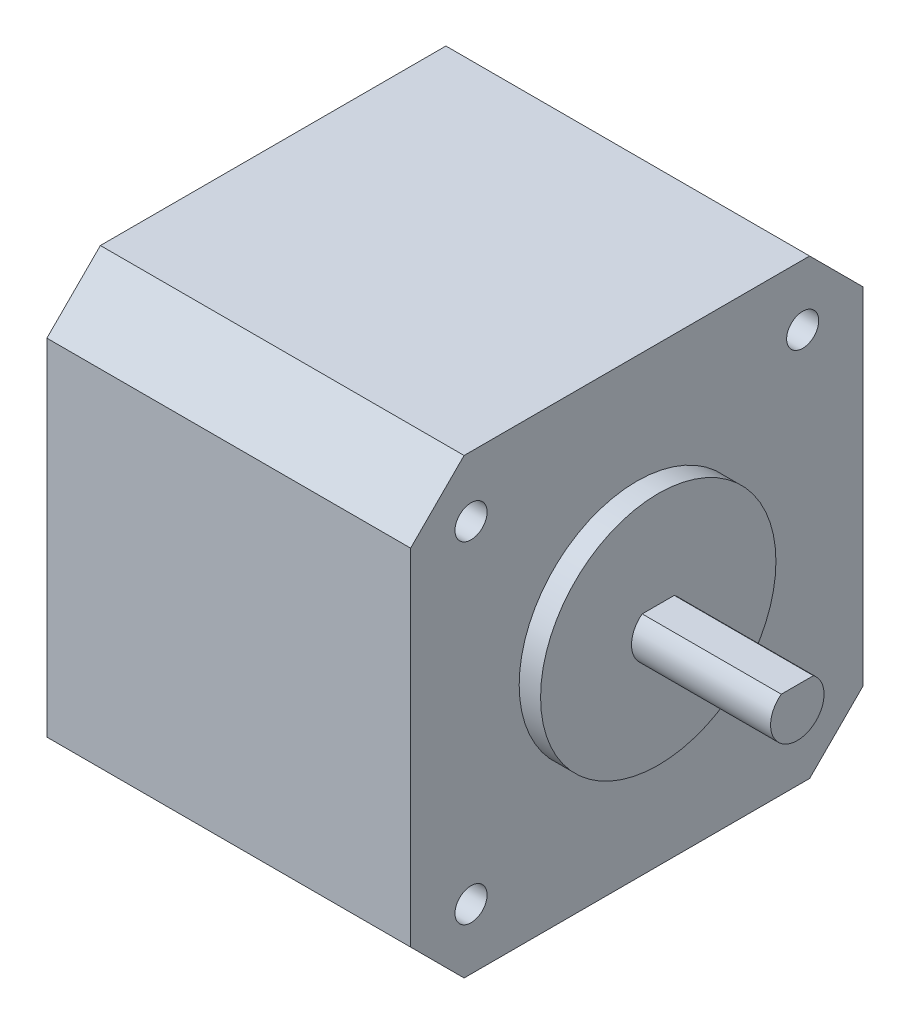
ISO-10303-21;
HEADER;
FILE_DESCRIPTION(('STEP AP214'),'2;1');
FILE_NAME('part.step','',(''),(''),'','','');
FILE_SCHEMA(('AUTOMOTIVE_DESIGN { 1 0 10303 214 1 1 1 1 }'));
ENDSEC;
DATA;
#1=APPLICATION_CONTEXT('core data for automotive mechanical design processes');
#2=APPLICATION_PROTOCOL_DEFINITION('international standard','automotive_design',2000,#1);
#3=PRODUCT_CONTEXT('',#1,'mechanical');
#4=PRODUCT('Part','Part','',(#3));
#5=PRODUCT_RELATED_PRODUCT_CATEGORY('part','',(#4));
#6=PRODUCT_DEFINITION_FORMATION('','',#4);
#7=PRODUCT_DEFINITION_CONTEXT('part definition',#1,'design');
#8=PRODUCT_DEFINITION('design','',#6,#7);
#9=PRODUCT_DEFINITION_SHAPE('','',#8);
#10=(LENGTH_UNIT() NAMED_UNIT(*) SI_UNIT(.MILLI.,.METRE.));
#11=(NAMED_UNIT(*) PLANE_ANGLE_UNIT() SI_UNIT($,.RADIAN.));
#12=(NAMED_UNIT(*) SI_UNIT($,.STERADIAN.) SOLID_ANGLE_UNIT());
#13=UNCERTAINTY_MEASURE_WITH_UNIT(LENGTH_MEASURE(1.E-05),#10,'distance_accuracy_value','');
#14=(GEOMETRIC_REPRESENTATION_CONTEXT(3) GLOBAL_UNCERTAINTY_ASSIGNED_CONTEXT((#13)) GLOBAL_UNIT_ASSIGNED_CONTEXT((#10,
#11,#12)) REPRESENTATION_CONTEXT('',''));
#15=CARTESIAN_POINT('',(0.,0.,0.));
#16=DIRECTION('',(0.,0.,1.));
#17=DIRECTION('',(1.,0.,0.));
#18=AXIS2_PLACEMENT_3D('',#15,#16,#17);
#19=CARTESIAN_POINT('',(34.,0.,-42.3));
#20=DIRECTION('',(0.,0.,1.));
#21=DIRECTION('',(1.,0.,0.));
#22=AXIS2_PLACEMENT_3D('',#19,#20,#21);
#23=PLANE('',#22);
#24=DIRECTION('',(0.,1.,0.));
#25=VECTOR('',#24,1.);
#26=CARTESIAN_POINT('',(0.,0.,-42.3));
#27=LINE('',#26,#25);
#28=CARTESIAN_POINT('',(0.,5.,-42.3));
#29=VERTEX_POINT('',#28);
#30=CARTESIAN_POINT('',(0.,37.3,-42.3));
#31=VERTEX_POINT('',#30);
#32=EDGE_CURVE('E158',#29,#31,#27,.T.);
#33=ORIENTED_EDGE('',*,*,#32,.T.);
#34=DIRECTION('',(-1.,0.,0.));
#35=VECTOR('',#34,1.);
#36=CARTESIAN_POINT('',(34.,37.3,-42.3));
#37=LINE('',#36,#35);
#38=CARTESIAN_POINT('',(34.,37.3,-42.3));
#39=VERTEX_POINT('',#38);
#40=EDGE_CURVE('E11',#39,#31,#37,.T.);
#41=ORIENTED_EDGE('',*,*,#40,.F.);
#42=DIRECTION('',(0.,1.,0.));
#43=VECTOR('',#42,1.);
#44=CARTESIAN_POINT('',(34.,0.,-42.3));
#45=LINE('',#44,#43);
#46=CARTESIAN_POINT('',(34.,5.,-42.3));
#47=VERTEX_POINT('',#46);
#48=EDGE_CURVE('E203',#47,#39,#45,.T.);
#49=ORIENTED_EDGE('',*,*,#48,.F.);
#50=DIRECTION('',(-1.,0.,0.));
#51=VECTOR('',#50,1.);
#52=CARTESIAN_POINT('',(34.,5.,-42.3));
#53=LINE('',#52,#51);
#54=EDGE_CURVE('E141',#47,#29,#53,.T.);
#55=ORIENTED_EDGE('',*,*,#54,.T.);
#56=EDGE_LOOP('',(#33,#41,#49,#55));
#57=FACE_BOUND('',#56,.T.);
#58=ADVANCED_FACE('F36',(#57),#23,.F.);
#59=CARTESIAN_POINT('',(34.,39.8,-39.8));
#60=DIRECTION('',(0.,-0.707106781186547,0.707106781186547));
#61=DIRECTION('',(0.,-0.707106781186548,-0.707106781186548));
#62=AXIS2_PLACEMENT_3D('',#59,#60,#61);
#63=PLANE('',#62);
#64=DIRECTION('',(0.,0.707106781186548,0.707106781186548));
#65=VECTOR('',#64,1.);
#66=CARTESIAN_POINT('',(0.,39.8,-39.8));
#67=LINE('',#66,#65);
#68=CARTESIAN_POINT('',(0.,42.3,-37.3));
#69=VERTEX_POINT('',#68);
#70=EDGE_CURVE('E161',#31,#69,#67,.T.);
#71=ORIENTED_EDGE('',*,*,#70,.T.);
#72=DIRECTION('',(-1.,0.,0.));
#73=VECTOR('',#72,1.);
#74=CARTESIAN_POINT('',(34.,42.3,-37.3));
#75=LINE('',#74,#73);
#76=CARTESIAN_POINT('',(34.,42.3,-37.3));
#77=VERTEX_POINT('',#76);
#78=EDGE_CURVE('E44',#77,#69,#75,.T.);
#79=ORIENTED_EDGE('',*,*,#78,.F.);
#80=DIRECTION('',(0.,0.707106781186548,0.707106781186548));
#81=VECTOR('',#80,1.);
#82=CARTESIAN_POINT('',(34.,39.8,-39.8));
#83=LINE('',#82,#81);
#84=EDGE_CURVE('E101',#39,#77,#83,.T.);
#85=ORIENTED_EDGE('',*,*,#84,.F.);
#86=ORIENTED_EDGE('',*,*,#40,.T.);
#87=EDGE_LOOP('',(#71,#79,#85,#86));
#88=FACE_BOUND('',#87,.T.);
#89=ADVANCED_FACE('F190',(#88),#63,.F.);
#90=CARTESIAN_POINT('',(34.,42.3,0.));
#91=DIRECTION('',(0.,1.,0.));
#92=DIRECTION('',(0.,0.,1.));
#93=AXIS2_PLACEMENT_3D('',#90,#91,#92);
#94=PLANE('',#93);
#95=DIRECTION('',(0.,0.,-1.));
#96=VECTOR('',#95,1.);
#97=CARTESIAN_POINT('',(0.,42.3,0.));
#98=LINE('',#97,#96);
#99=CARTESIAN_POINT('',(0.,42.3,-5.));
#100=VERTEX_POINT('',#99);
#101=EDGE_CURVE('E164',#100,#69,#98,.T.);
#102=ORIENTED_EDGE('',*,*,#101,.F.);
#103=DIRECTION('',(-1.,0.,0.));
#104=VECTOR('',#103,1.);
#105=CARTESIAN_POINT('',(34.,42.3,-5.));
#106=LINE('',#105,#104);
#107=CARTESIAN_POINT('',(34.,42.3,-5.));
#108=VERTEX_POINT('',#107);
#109=EDGE_CURVE('E183',#108,#100,#106,.T.);
#110=ORIENTED_EDGE('',*,*,#109,.F.);
#111=DIRECTION('',(0.,0.,-1.));
#112=VECTOR('',#111,1.);
#113=CARTESIAN_POINT('',(34.,42.3,0.));
#114=LINE('',#113,#112);
#115=EDGE_CURVE('E189',#108,#77,#114,.T.);
#116=ORIENTED_EDGE('',*,*,#115,.T.);
#117=ORIENTED_EDGE('',*,*,#78,.T.);
#118=EDGE_LOOP('',(#102,#110,#116,#117));
#119=FACE_BOUND('',#118,.T.);
#120=ADVANCED_FACE('F187',(#119),#94,.T.);
#121=CARTESIAN_POINT('',(34.,18.65,18.65));
#122=DIRECTION('',(0.,0.707106781186548,0.707106781186547));
#123=DIRECTION('',(0.,-0.707106781186547,0.707106781186548));
#124=AXIS2_PLACEMENT_3D('',#121,#122,#123);
#125=PLANE('',#124);
#126=DIRECTION('',(0.,0.707106781186547,-0.707106781186548));
#127=VECTOR('',#126,1.);
#128=CARTESIAN_POINT('',(0.,18.65,18.65));
#129=LINE('',#128,#127);
#130=CARTESIAN_POINT('',(0.,37.3,0.));
#131=VERTEX_POINT('',#130);
#132=EDGE_CURVE('E167',#131,#100,#129,.T.);
#133=ORIENTED_EDGE('',*,*,#132,.F.);
#134=DIRECTION('',(-1.,0.,0.));
#135=VECTOR('',#134,1.);
#136=CARTESIAN_POINT('',(34.,37.3,0.));
#137=LINE('',#136,#135);
#138=CARTESIAN_POINT('',(34.,37.3,0.));
#139=VERTEX_POINT('',#138);
#140=EDGE_CURVE('E181',#139,#131,#137,.T.);
#141=ORIENTED_EDGE('',*,*,#140,.F.);
#142=DIRECTION('',(0.,0.707106781186547,-0.707106781186548));
#143=VECTOR('',#142,1.);
#144=CARTESIAN_POINT('',(34.,18.65,18.65));
#145=LINE('',#144,#143);
#146=EDGE_CURVE('E200',#139,#108,#145,.T.);
#147=ORIENTED_EDGE('',*,*,#146,.T.);
#148=ORIENTED_EDGE('',*,*,#109,.T.);
#149=EDGE_LOOP('',(#133,#141,#147,#148));
#150=FACE_BOUND('',#149,.T.);
#151=ADVANCED_FACE('F198',(#150),#125,.T.);
#152=CARTESIAN_POINT('',(34.,0.,0.));
#153=DIRECTION('',(0.,0.,1.));
#154=DIRECTION('',(1.,0.,0.));
#155=AXIS2_PLACEMENT_3D('',#152,#153,#154);
#156=PLANE('',#155);
#157=DIRECTION('',(0.,1.,0.));
#158=VECTOR('',#157,1.);
#159=CARTESIAN_POINT('',(0.,0.,0.));
#160=LINE('',#159,#158);
#161=CARTESIAN_POINT('',(0.,5.,0.));
#162=VERTEX_POINT('',#161);
#163=EDGE_CURVE('E170',#162,#131,#160,.T.);
#164=ORIENTED_EDGE('',*,*,#163,.F.);
#165=DIRECTION('',(-1.,0.,0.));
#166=VECTOR('',#165,1.);
#167=CARTESIAN_POINT('',(34.,5.,0.));
#168=LINE('',#167,#166);
#169=CARTESIAN_POINT('',(34.,5.,0.));
#170=VERTEX_POINT('',#169);
#171=EDGE_CURVE('E136',#170,#162,#168,.T.);
#172=ORIENTED_EDGE('',*,*,#171,.F.);
#173=DIRECTION('',(0.,1.,0.));
#174=VECTOR('',#173,1.);
#175=CARTESIAN_POINT('',(34.,0.,0.));
#176=LINE('',#175,#174);
#177=EDGE_CURVE('E126',#170,#139,#176,.T.);
#178=ORIENTED_EDGE('',*,*,#177,.T.);
#179=ORIENTED_EDGE('',*,*,#140,.T.);
#180=EDGE_LOOP('',(#164,#172,#178,#179));
#181=FACE_BOUND('',#180,.T.);
#182=ADVANCED_FACE('F207',(#181),#156,.T.);
#183=CARTESIAN_POINT('',(34.,2.5,-2.5));
#184=DIRECTION('',(0.,0.707106781186547,-0.707106781186547));
#185=DIRECTION('',(0.,0.707106781186548,0.707106781186548));
#186=AXIS2_PLACEMENT_3D('',#183,#184,#185);
#187=PLANE('',#186);
#188=DIRECTION('',(0.,-0.707106781186548,-0.707106781186548));
#189=VECTOR('',#188,1.);
#190=CARTESIAN_POINT('',(0.,2.5,-2.5));
#191=LINE('',#190,#189);
#192=CARTESIAN_POINT('',(0.,0.,-5.));
#193=VERTEX_POINT('',#192);
#194=EDGE_CURVE('E133',#162,#193,#191,.T.);
#195=ORIENTED_EDGE('',*,*,#194,.T.);
#196=DIRECTION('',(-1.,0.,0.));
#197=VECTOR('',#196,1.);
#198=CARTESIAN_POINT('',(34.,0.,-5.));
#199=LINE('',#198,#197);
#200=CARTESIAN_POINT('',(34.,0.,-5.));
#201=VERTEX_POINT('',#200);
#202=EDGE_CURVE('E130',#201,#193,#199,.T.);
#203=ORIENTED_EDGE('',*,*,#202,.F.);
#204=DIRECTION('',(0.,-0.707106781186548,-0.707106781186548));
#205=VECTOR('',#204,1.);
#206=CARTESIAN_POINT('',(34.,2.5,-2.5));
#207=LINE('',#206,#205);
#208=EDGE_CURVE('E118',#170,#201,#207,.T.);
#209=ORIENTED_EDGE('',*,*,#208,.F.);
#210=ORIENTED_EDGE('',*,*,#171,.T.);
#211=EDGE_LOOP('',(#195,#203,#209,#210));
#212=FACE_BOUND('',#211,.T.);
#213=ADVANCED_FACE('F131',(#212),#187,.F.);
#214=CARTESIAN_POINT('',(34.,0.,0.));
#215=DIRECTION('',(0.,1.,0.));
#216=DIRECTION('',(0.,0.,1.));
#217=AXIS2_PLACEMENT_3D('',#214,#215,#216);
#218=PLANE('',#217);
#219=DIRECTION('',(0.,0.,-1.));
#220=VECTOR('',#219,1.);
#221=CARTESIAN_POINT('',(0.,0.,0.));
#222=LINE('',#221,#220);
#223=CARTESIAN_POINT('',(0.,0.,-37.3));
#224=VERTEX_POINT('',#223);
#225=EDGE_CURVE('E174',#193,#224,#222,.T.);
#226=ORIENTED_EDGE('',*,*,#225,.T.);
#227=DIRECTION('',(-1.,0.,0.));
#228=VECTOR('',#227,1.);
#229=CARTESIAN_POINT('',(34.,0.,-37.3));
#230=LINE('',#229,#228);
#231=CARTESIAN_POINT('',(34.,0.,-37.3));
#232=VERTEX_POINT('',#231);
#233=EDGE_CURVE('E137',#232,#224,#230,.T.);
#234=ORIENTED_EDGE('',*,*,#233,.F.);
#235=DIRECTION('',(0.,0.,-1.));
#236=VECTOR('',#235,1.);
#237=CARTESIAN_POINT('',(34.,0.,0.));
#238=LINE('',#237,#236);
#239=EDGE_CURVE('E122',#201,#232,#238,.T.);
#240=ORIENTED_EDGE('',*,*,#239,.F.);
#241=ORIENTED_EDGE('',*,*,#202,.T.);
#242=EDGE_LOOP('',(#226,#234,#240,#241));
#243=FACE_BOUND('',#242,.T.);
#244=ADVANCED_FACE('F139',(#243),#218,.F.);
#245=CARTESIAN_POINT('',(34.,36.65,-5.65));
#246=DIRECTION('',(-1.,0.,0.));
#247=DIRECTION('',(0.,0.,1.));
#248=AXIS2_PLACEMENT_3D('',#245,#246,#247);
#249=CYLINDRICAL_SURFACE('',#248,1.5);
#250=CARTESIAN_POINT('',(34.,36.65,-5.65));
#251=DIRECTION('',(1.,0.,0.));
#252=DIRECTION('',(0.,0.,-1.));
#253=AXIS2_PLACEMENT_3D('',#250,#251,#252);
#254=CIRCLE('',#253,1.5);
#255=CARTESIAN_POINT('',(34.,36.65,-7.15));
#256=VERTEX_POINT('',#255);
#257=EDGE_CURVE('E211',#256,#256,#254,.T.);
#258=ORIENTED_EDGE('',*,*,#257,.T.);
#259=EDGE_LOOP('',(#258));
#260=FACE_BOUND('',#259,.T.);
#261=CARTESIAN_POINT('',(0.,36.65,-5.65));
#262=DIRECTION('',(1.,0.,0.));
#263=DIRECTION('',(0.,0.,-1.));
#264=AXIS2_PLACEMENT_3D('',#261,#262,#263);
#265=CIRCLE('',#264,1.5);
#266=CARTESIAN_POINT('',(0.,36.65,-7.15));
#267=VERTEX_POINT('',#266);
#268=EDGE_CURVE('E155',#267,#267,#265,.T.);
#269=ORIENTED_EDGE('',*,*,#268,.F.);
#270=EDGE_LOOP('',(#269));
#271=FACE_BOUND('',#270,.T.);
#272=ADVANCED_FACE('F276',(#260,#271),#249,.F.);
#273=CARTESIAN_POINT('',(34.,36.65,-36.65));
#274=DIRECTION('',(-1.,0.,0.));
#275=DIRECTION('',(0.,0.,1.));
#276=AXIS2_PLACEMENT_3D('',#273,#274,#275);
#277=CYLINDRICAL_SURFACE('',#276,1.5);
#278=CARTESIAN_POINT('',(34.,36.65,-36.65));
#279=DIRECTION('',(1.,0.,0.));
#280=DIRECTION('',(0.,0.,-1.));
#281=AXIS2_PLACEMENT_3D('',#278,#279,#280);
#282=CIRCLE('',#281,1.5);
#283=CARTESIAN_POINT('',(34.,36.65,-38.15));
#284=VERTEX_POINT('',#283);
#285=EDGE_CURVE('E213',#284,#284,#282,.T.);
#286=ORIENTED_EDGE('',*,*,#285,.T.);
#287=EDGE_LOOP('',(#286));
#288=FACE_BOUND('',#287,.T.);
#289=CARTESIAN_POINT('',(0.,36.65,-36.65));
#290=DIRECTION('',(1.,0.,0.));
#291=DIRECTION('',(0.,0.,-1.));
#292=AXIS2_PLACEMENT_3D('',#289,#290,#291);
#293=CIRCLE('',#292,1.5);
#294=CARTESIAN_POINT('',(0.,36.65,-38.15));
#295=VERTEX_POINT('',#294);
#296=EDGE_CURVE('E152',#295,#295,#293,.T.);
#297=ORIENTED_EDGE('',*,*,#296,.F.);
#298=EDGE_LOOP('',(#297));
#299=FACE_BOUND('',#298,.T.);
#300=ADVANCED_FACE('F279',(#288,#299),#277,.F.);
#301=CARTESIAN_POINT('',(34.,5.65,-36.65));
#302=DIRECTION('',(-1.,0.,0.));
#303=DIRECTION('',(0.,0.,1.));
#304=AXIS2_PLACEMENT_3D('',#301,#302,#303);
#305=CYLINDRICAL_SURFACE('',#304,1.5);
#306=CARTESIAN_POINT('',(34.,5.65,-36.65));
#307=DIRECTION('',(1.,0.,0.));
#308=DIRECTION('',(0.,0.,-1.));
#309=AXIS2_PLACEMENT_3D('',#306,#307,#308);
#310=CIRCLE('',#309,1.5);
#311=CARTESIAN_POINT('',(34.,5.65,-38.15));
#312=VERTEX_POINT('',#311);
#313=EDGE_CURVE('E218',#312,#312,#310,.T.);
#314=ORIENTED_EDGE('',*,*,#313,.T.);
#315=EDGE_LOOP('',(#314));
#316=FACE_BOUND('',#315,.T.);
#317=CARTESIAN_POINT('',(0.,5.65,-36.65));
#318=DIRECTION('',(1.,0.,0.));
#319=DIRECTION('',(0.,0.,-1.));
#320=AXIS2_PLACEMENT_3D('',#317,#318,#319);
#321=CIRCLE('',#320,1.5);
#322=CARTESIAN_POINT('',(0.,5.65,-38.15));
#323=VERTEX_POINT('',#322);
#324=EDGE_CURVE('E148',#323,#323,#321,.T.);
#325=ORIENTED_EDGE('',*,*,#324,.F.);
#326=EDGE_LOOP('',(#325));
#327=FACE_BOUND('',#326,.T.);
#328=ADVANCED_FACE('F299',(#316,#327),#305,.F.);
#329=CARTESIAN_POINT('',(34.,5.65,-5.65));
#330=DIRECTION('',(-1.,0.,0.));
#331=DIRECTION('',(0.,0.,1.));
#332=AXIS2_PLACEMENT_3D('',#329,#330,#331);
#333=CYLINDRICAL_SURFACE('',#332,1.5);
#334=CARTESIAN_POINT('',(34.,5.65,-5.65));
#335=DIRECTION('',(1.,0.,0.));
#336=DIRECTION('',(0.,0.,-1.));
#337=AXIS2_PLACEMENT_3D('',#334,#335,#336);
#338=CIRCLE('',#337,1.5);
#339=CARTESIAN_POINT('',(34.,5.65,-7.15));
#340=VERTEX_POINT('',#339);
#341=EDGE_CURVE('E177',#340,#340,#338,.T.);
#342=ORIENTED_EDGE('',*,*,#341,.T.);
#343=EDGE_LOOP('',(#342));
#344=FACE_BOUND('',#343,.T.);
#345=CARTESIAN_POINT('',(0.,5.65,-5.65));
#346=DIRECTION('',(1.,0.,0.));
#347=DIRECTION('',(0.,0.,-1.));
#348=AXIS2_PLACEMENT_3D('',#345,#346,#347);
#349=CIRCLE('',#348,1.5);
#350=CARTESIAN_POINT('',(0.,5.65,-7.15));
#351=VERTEX_POINT('',#350);
#352=EDGE_CURVE('E145',#351,#351,#349,.T.);
#353=ORIENTED_EDGE('',*,*,#352,.F.);
#354=EDGE_LOOP('',(#353));
#355=FACE_BOUND('',#354,.T.);
#356=ADVANCED_FACE('F38',(#344,#355),#333,.F.);
#357=CARTESIAN_POINT('',(34.,-18.65,-18.65));
#358=DIRECTION('',(0.,0.707106781186547,0.707106781186548));
#359=DIRECTION('',(0.,-0.707106781186548,0.707106781186547));
#360=AXIS2_PLACEMENT_3D('',#357,#358,#359);
#361=PLANE('',#360);
#362=DIRECTION('',(0.,0.707106781186548,-0.707106781186547));
#363=VECTOR('',#362,1.);
#364=CARTESIAN_POINT('',(0.,-18.65,-18.65));
#365=LINE('',#364,#363);
#366=EDGE_CURVE('E93',#224,#29,#365,.T.);
#367=ORIENTED_EDGE('',*,*,#366,.T.);
#368=ORIENTED_EDGE('',*,*,#54,.F.);
#369=DIRECTION('',(0.,0.707106781186548,-0.707106781186547));
#370=VECTOR('',#369,1.);
#371=CARTESIAN_POINT('',(34.,-18.65,-18.65));
#372=LINE('',#371,#370);
#373=EDGE_CURVE('E60',#232,#47,#372,.T.);
#374=ORIENTED_EDGE('',*,*,#373,.F.);
#375=ORIENTED_EDGE('',*,*,#233,.T.);
#376=EDGE_LOOP('',(#367,#368,#374,#375));
#377=FACE_BOUND('',#376,.T.);
#378=ADVANCED_FACE('F208',(#377),#361,.F.);
#379=CARTESIAN_POINT('',(34.,0.,0.));
#380=DIRECTION('',(1.,0.,0.));
#381=DIRECTION('',(0.,0.,-1.));
#382=AXIS2_PLACEMENT_3D('',#379,#380,#381);
#383=PLANE('',#382);
#384=CARTESIAN_POINT('',(34.,21.15,-21.15));
#385=DIRECTION('',(1.,0.,0.));
#386=DIRECTION('',(0.,0.,-1.));
#387=AXIS2_PLACEMENT_3D('',#384,#385,#386);
#388=CIRCLE('',#387,11.);
#389=CARTESIAN_POINT('',(34.,21.15,-32.15));
#390=VERTEX_POINT('',#389);
#391=EDGE_CURVE('E223',#390,#390,#388,.T.);
#392=ORIENTED_EDGE('',*,*,#391,.F.);
#393=EDGE_LOOP('',(#392));
#394=FACE_BOUND('',#393,.T.);
#395=ORIENTED_EDGE('',*,*,#341,.F.);
#396=EDGE_LOOP('',(#395));
#397=FACE_BOUND('',#396,.T.);
#398=ORIENTED_EDGE('',*,*,#313,.F.);
#399=EDGE_LOOP('',(#398));
#400=FACE_BOUND('',#399,.T.);
#401=ORIENTED_EDGE('',*,*,#285,.F.);
#402=EDGE_LOOP('',(#401));
#403=FACE_BOUND('',#402,.T.);
#404=ORIENTED_EDGE('',*,*,#257,.F.);
#405=EDGE_LOOP('',(#404));
#406=FACE_BOUND('',#405,.T.);
#407=ORIENTED_EDGE('',*,*,#48,.T.);
#408=ORIENTED_EDGE('',*,*,#84,.T.);
#409=ORIENTED_EDGE('',*,*,#115,.F.);
#410=ORIENTED_EDGE('',*,*,#146,.F.);
#411=ORIENTED_EDGE('',*,*,#177,.F.);
#412=ORIENTED_EDGE('',*,*,#208,.T.);
#413=ORIENTED_EDGE('',*,*,#239,.T.);
#414=ORIENTED_EDGE('',*,*,#373,.T.);
#415=EDGE_LOOP('',(#407,#408,#409,#410,#411,#412,#413,#414));
#416=FACE_BOUND('',#415,.T.);
#417=ADVANCED_FACE('F120',(#394,#397,#400,#403,#406,#416),#383,.T.);
#418=CARTESIAN_POINT('',(0.,0.,0.));
#419=DIRECTION('',(1.,0.,0.));
#420=DIRECTION('',(0.,0.,-1.));
#421=AXIS2_PLACEMENT_3D('',#418,#419,#420);
#422=PLANE('',#421);
#423=ORIENTED_EDGE('',*,*,#352,.T.);
#424=EDGE_LOOP('',(#423));
#425=FACE_BOUND('',#424,.T.);
#426=ORIENTED_EDGE('',*,*,#324,.T.);
#427=EDGE_LOOP('',(#426));
#428=FACE_BOUND('',#427,.T.);
#429=ORIENTED_EDGE('',*,*,#296,.T.);
#430=EDGE_LOOP('',(#429));
#431=FACE_BOUND('',#430,.T.);
#432=ORIENTED_EDGE('',*,*,#268,.T.);
#433=EDGE_LOOP('',(#432));
#434=FACE_BOUND('',#433,.T.);
#435=ORIENTED_EDGE('',*,*,#32,.F.);
#436=ORIENTED_EDGE('',*,*,#366,.F.);
#437=ORIENTED_EDGE('',*,*,#225,.F.);
#438=ORIENTED_EDGE('',*,*,#194,.F.);
#439=ORIENTED_EDGE('',*,*,#163,.T.);
#440=ORIENTED_EDGE('',*,*,#132,.T.);
#441=ORIENTED_EDGE('',*,*,#101,.T.);
#442=ORIENTED_EDGE('',*,*,#70,.F.);
#443=EDGE_LOOP('',(#435,#436,#437,#438,#439,#440,#441,#442));
#444=FACE_BOUND('',#443,.T.);
#445=ADVANCED_FACE('F194',(#425,#428,#431,#434,#444),#422,.F.);
#446=CARTESIAN_POINT('',(36.,21.15,-21.15));
#447=DIRECTION('',(-1.,0.,0.));
#448=DIRECTION('',(0.,0.,1.));
#449=AXIS2_PLACEMENT_3D('',#446,#447,#448);
#450=CYLINDRICAL_SURFACE('',#449,11.);
#451=CARTESIAN_POINT('',(36.,21.15,-21.15));
#452=DIRECTION('',(1.,0.,0.));
#453=DIRECTION('',(0.,0.,-1.));
#454=AXIS2_PLACEMENT_3D('',#451,#452,#453);
#455=CIRCLE('',#454,11.);
#456=CARTESIAN_POINT('',(36.,21.15,-32.15));
#457=VERTEX_POINT('',#456);
#458=EDGE_CURVE('E149',#457,#457,#455,.T.);
#459=ORIENTED_EDGE('',*,*,#458,.F.);
#460=EDGE_LOOP('',(#459));
#461=FACE_BOUND('',#460,.T.);
#462=ORIENTED_EDGE('',*,*,#391,.T.);
#463=EDGE_LOOP('',(#462));
#464=FACE_BOUND('',#463,.T.);
#465=ADVANCED_FACE('F256',(#461,#464),#450,.T.);
#466=CARTESIAN_POINT('',(36.,21.15,-21.15));
#467=DIRECTION('',(1.,0.,0.));
#468=DIRECTION('',(0.,0.,-1.));
#469=AXIS2_PLACEMENT_3D('',#466,#467,#468);
#470=PLANE('',#469);
#471=CARTESIAN_POINT('',(36.,21.15,-21.15));
#472=DIRECTION('',(1.,0.,0.));
#473=DIRECTION('',(0.,0.,-1.));
#474=AXIS2_PLACEMENT_3D('',#471,#472,#473);
#475=CIRCLE('',#474,2.5);
#476=CARTESIAN_POINT('',(36.,23.15,-19.65));
#477=VERTEX_POINT('',#476);
#478=CARTESIAN_POINT('',(36.,23.15,-22.65));
#479=VERTEX_POINT('',#478);
#480=EDGE_CURVE('E51',#477,#479,#475,.T.);
#481=ORIENTED_EDGE('',*,*,#480,.F.);
#482=DIRECTION('',(0.,0.,-1.));
#483=VECTOR('',#482,1.);
#484=CARTESIAN_POINT('',(36.,23.15,-19.65));
#485=LINE('',#484,#483);
#486=EDGE_CURVE('E233',#477,#479,#485,.T.);
#487=ORIENTED_EDGE('',*,*,#486,.T.);
#488=EDGE_LOOP('',(#481,#487));
#489=FACE_BOUND('',#488,.T.);
#490=ORIENTED_EDGE('',*,*,#458,.T.);
#491=EDGE_LOOP('',(#490));
#492=FACE_BOUND('',#491,.T.);
#493=ADVANCED_FACE('F253',(#489,#492),#470,.T.);
#494=CARTESIAN_POINT('',(49.,21.15,-21.15));
#495=DIRECTION('',(-1.,0.,0.));
#496=DIRECTION('',(0.,0.,1.));
#497=AXIS2_PLACEMENT_3D('',#494,#495,#496);
#498=CYLINDRICAL_SURFACE('',#497,2.5);
#499=ORIENTED_EDGE('',*,*,#480,.T.);
#500=DIRECTION('',(-1.,0.,0.));
#501=VECTOR('',#500,1.);
#502=CARTESIAN_POINT('',(49.,23.15,-22.65));
#503=LINE('',#502,#501);
#504=CARTESIAN_POINT('',(49.,23.15,-22.65));
#505=VERTEX_POINT('',#504);
#506=EDGE_CURVE('E226',#505,#479,#503,.T.);
#507=ORIENTED_EDGE('',*,*,#506,.F.);
#508=CARTESIAN_POINT('',(49.,21.15,-21.15));
#509=DIRECTION('',(1.,0.,0.));
#510=DIRECTION('',(0.,0.,-1.));
#511=AXIS2_PLACEMENT_3D('',#508,#509,#510);
#512=CIRCLE('',#511,2.5);
#513=CARTESIAN_POINT('',(49.,23.15,-19.65));
#514=VERTEX_POINT('',#513);
#515=EDGE_CURVE('E236',#514,#505,#512,.T.);
#516=ORIENTED_EDGE('',*,*,#515,.F.);
#517=DIRECTION('',(-1.,0.,0.));
#518=VECTOR('',#517,1.);
#519=CARTESIAN_POINT('',(49.,23.15,-19.65));
#520=LINE('',#519,#518);
#521=EDGE_CURVE('E230',#514,#477,#520,.T.);
#522=ORIENTED_EDGE('',*,*,#521,.T.);
#523=EDGE_LOOP('',(#499,#507,#516,#522));
#524=FACE_BOUND('',#523,.T.);
#525=ADVANCED_FACE('F247',(#524),#498,.T.);
#526=CARTESIAN_POINT('',(49.,23.15,-19.65));
#527=DIRECTION('',(0.,1.,0.));
#528=DIRECTION('',(0.,0.,1.));
#529=AXIS2_PLACEMENT_3D('',#526,#527,#528);
#530=PLANE('',#529);
#531=ORIENTED_EDGE('',*,*,#486,.F.);
#532=ORIENTED_EDGE('',*,*,#521,.F.);
#533=DIRECTION('',(0.,0.,-1.));
#534=VECTOR('',#533,1.);
#535=CARTESIAN_POINT('',(49.,23.15,-19.65));
#536=LINE('',#535,#534);
#537=EDGE_CURVE('E232',#514,#505,#536,.T.);
#538=ORIENTED_EDGE('',*,*,#537,.T.);
#539=ORIENTED_EDGE('',*,*,#506,.T.);
#540=EDGE_LOOP('',(#531,#532,#538,#539));
#541=FACE_BOUND('',#540,.T.);
#542=ADVANCED_FACE('F251',(#541),#530,.T.);
#543=CARTESIAN_POINT('',(49.,21.15,-21.15));
#544=DIRECTION('',(1.,0.,0.));
#545=DIRECTION('',(0.,0.,-1.));
#546=AXIS2_PLACEMENT_3D('',#543,#544,#545);
#547=PLANE('',#546);
#548=ORIENTED_EDGE('',*,*,#515,.T.);
#549=ORIENTED_EDGE('',*,*,#537,.F.);
#550=EDGE_LOOP('',(#548,#549));
#551=FACE_BOUND('',#550,.T.);
#552=ADVANCED_FACE('F245',(#551),#547,.T.);
#553=CLOSED_SHELL('',(#58,#89,#120,#151,#182,#213,#244,#272,#300,#328,#356,#378,#417,#445,#465,
#493,#525,#542,#552));
#554=MANIFOLD_SOLID_BREP('B2',#553);
#555=ADVANCED_BREP_SHAPE_REPRESENTATION('',(#18,#554),#14);
#556=SHAPE_DEFINITION_REPRESENTATION(#9,#555);
ENDSEC;
END-ISO-10303-21;
